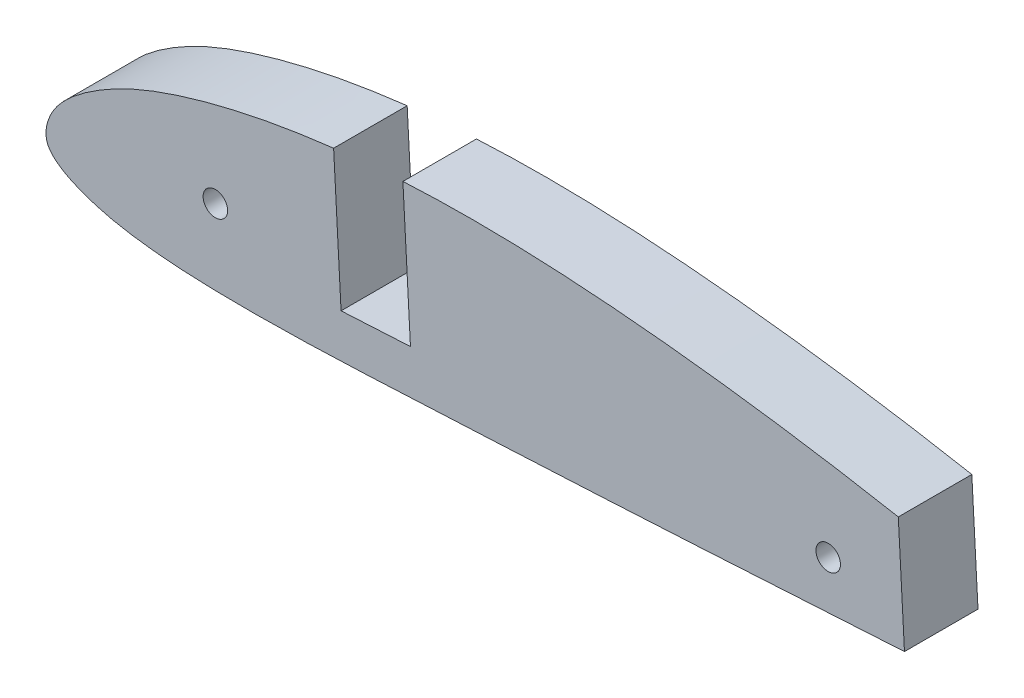
ISO-10303-21;
HEADER;
FILE_DESCRIPTION(('STEP AP214'),'2;1');
FILE_NAME('part.step','',(''),(''),'','','');
FILE_SCHEMA(('AUTOMOTIVE_DESIGN { 1 0 10303 214 1 1 1 1 }'));
ENDSEC;
DATA;
#1=APPLICATION_CONTEXT('core data for automotive mechanical design processes');
#2=APPLICATION_PROTOCOL_DEFINITION('international standard','automotive_design',2000,#1);
#3=PRODUCT_CONTEXT('',#1,'mechanical');
#4=PRODUCT('Part','Part','',(#3));
#5=PRODUCT_RELATED_PRODUCT_CATEGORY('part','',(#4));
#6=PRODUCT_DEFINITION_FORMATION('','',#4);
#7=PRODUCT_DEFINITION_CONTEXT('part definition',#1,'design');
#8=PRODUCT_DEFINITION('design','',#6,#7);
#9=PRODUCT_DEFINITION_SHAPE('','',#8);
#10=(LENGTH_UNIT() NAMED_UNIT(*) SI_UNIT(.MILLI.,.METRE.));
#11=(NAMED_UNIT(*) PLANE_ANGLE_UNIT() SI_UNIT($,.RADIAN.));
#12=(NAMED_UNIT(*) SI_UNIT($,.STERADIAN.) SOLID_ANGLE_UNIT());
#13=UNCERTAINTY_MEASURE_WITH_UNIT(LENGTH_MEASURE(1.E-05),#10,'distance_accuracy_value','');
#14=(GEOMETRIC_REPRESENTATION_CONTEXT(3) GLOBAL_UNCERTAINTY_ASSIGNED_CONTEXT((#13)) GLOBAL_UNIT_ASSIGNED_CONTEXT((#10,
#11,#12)) REPRESENTATION_CONTEXT('',''));
#15=CARTESIAN_POINT('',(0.,0.,0.));
#16=DIRECTION('',(0.,0.,1.));
#17=DIRECTION('',(1.,0.,0.));
#18=AXIS2_PLACEMENT_3D('',#15,#16,#17);
#19=CARTESIAN_POINT('',(109.451798245431,-5.08,7.62));
#20=CARTESIAN_POINT('',(109.454459178744,-5.0694258075468,7.62));
#21=CARTESIAN_POINT('',(109.156485113387,-4.98893370323383,7.62));
#22=CARTESIAN_POINT('',(108.862479978843,-4.85461195717568,7.62));
#23=CARTESIAN_POINT('',(108.123918831792,-4.60117460669964,7.62));
#24=CARTESIAN_POINT('',(107.210252378163,-4.27511376250752,7.62));
#25=CARTESIAN_POINT('',(105.996957401387,-3.86412804078641,7.62));
#26=CARTESIAN_POINT('',(104.53923708378,-3.39638968784611,7.62));
#27=CARTESIAN_POINT('',(102.825319980878,-2.87269416847168,7.62));
#28=CARTESIAN_POINT('',(100.868609031412,-2.30429498547947,7.62));
#29=CARTESIAN_POINT('',(98.677120018108,-1.68869250290389,7.62));
#30=CARTESIAN_POINT('',(96.2607696880802,-1.03022566798201,7.62));
#31=CARTESIAN_POINT('',(93.6287885564061,-0.338112688202309,7.62));
#32=CARTESIAN_POINT('',(90.7922213295436,0.379443625793548,7.62));
#33=CARTESIAN_POINT('',(87.763546501109,1.11431874333265,7.62));
#34=CARTESIAN_POINT('',(84.5564227101674,1.86229543610744,7.62));
#35=CARTESIAN_POINT('',(81.1839302502545,2.61699936289568,7.62));
#36=CARTESIAN_POINT('',(77.6604626634929,3.37053566938624,7.62));
#37=CARTESIAN_POINT('',(74.0010871470234,4.11297119869992,7.62));
#38=CARTESIAN_POINT('',(70.2214341758904,4.83293517068693,7.62));
#39=CARTESIAN_POINT('',(66.3383847064585,5.52614773239327,7.62));
#40=CARTESIAN_POINT('',(62.3677609232154,6.18164020219338,7.62));
#41=CARTESIAN_POINT('',(58.3265125103218,6.79467104657786,7.62));
#42=CARTESIAN_POINT('',(54.2322654270605,7.3581142754929,7.62));
#43=CARTESIAN_POINT('',(50.1022571746908,7.86521701869206,7.62));
#44=CARTESIAN_POINT('',(45.9552044921986,8.314460056631,7.62));
#45=CARTESIAN_POINT('',(41.8078837688901,8.69458239306826,7.62));
#46=CARTESIAN_POINT('',(37.6778363852409,8.99935984883897,7.62));
#47=CARTESIAN_POINT('',(33.5831190485169,9.21958181200142,7.62));
#48=CARTESIAN_POINT('',(29.5409359542949,9.34484403364536,7.62));
#49=CARTESIAN_POINT('',(25.5691488449866,9.36615166551586,7.62));
#50=CARTESIAN_POINT('',(21.6842898563108,9.28357115971868,7.62));
#51=CARTESIAN_POINT('',(17.9029694699595,9.09080508611618,7.62));
#52=CARTESIAN_POINT('',(14.2414370042572,8.7901066249628,7.62));
#53=CARTESIAN_POINT('',(10.7158433347186,8.38653772777966,7.62));
#54=CARTESIAN_POINT('',(7.34129415025395,7.8879080307597,7.62));
#55=CARTESIAN_POINT('',(4.13154087545609,7.30231347263919,7.62));
#56=CARTESIAN_POINT('',(1.10132100092707,6.62948617803047,7.62));
#57=CARTESIAN_POINT('',(-1.73752956384269,5.88532139130179,7.62));
#58=CARTESIAN_POINT('',(-4.37422419748082,5.08138202904439,7.62));
#59=CARTESIAN_POINT('',(-6.79803409663357,4.21512382907975,7.62));
#60=CARTESIAN_POINT('',(-8.99434944048081,3.2765844082489,7.62));
#61=CARTESIAN_POINT('',(-10.9551443346364,2.28063145613607,7.62));
#62=CARTESIAN_POINT('',(-12.6686354294678,1.24621608471318,7.62));
#63=CARTESIAN_POINT('',(-14.1399104434869,0.212705200843522,7.62));
#64=CARTESIAN_POINT('',(-15.3576774886313,-0.820744476133744,7.62));
#65=CARTESIAN_POINT('',(-16.3295875394342,-1.85673893959521,7.62));
#66=CARTESIAN_POINT('',(-17.0202628363783,-2.92281035826037,7.62));
#67=CARTESIAN_POINT('',(-17.4333115493092,-3.96809924516641,7.62));
#68=CARTESIAN_POINT('',(-17.5940544635785,-4.93610308833838,7.62));
#69=CARTESIAN_POINT('',(-17.4702175183407,-5.8088750473589,7.62));
#70=CARTESIAN_POINT('',(-17.0086699305709,-6.54105129294257,7.62));
#71=CARTESIAN_POINT('',(-16.2891353909068,-7.16046076096368,7.62));
#72=CARTESIAN_POINT('',(-15.3346647951794,-7.75507397664849,7.62));
#73=CARTESIAN_POINT('',(-14.1159134721564,-8.30420201060925,7.62));
#74=CARTESIAN_POINT('',(-12.6509130514106,-8.82509795076425,7.62));
#75=CARTESIAN_POINT('',(-10.9336053977492,-9.28593558990606,7.62));
#76=CARTESIAN_POINT('',(-8.97172749068822,-9.66043772730412,7.62));
#77=CARTESIAN_POINT('',(-6.77656462348316,-9.95195932071161,7.62));
#78=CARTESIAN_POINT('',(-4.35740448122734,-10.1686680412697,7.62));
#79=CARTESIAN_POINT('',(-1.72342073780623,-10.3101291264901,7.62));
#80=CARTESIAN_POINT('',(1.11440166995971,-10.3826502445106,7.62));
#81=CARTESIAN_POINT('',(4.14351152847955,-10.3925875239466,7.62));
#82=CARTESIAN_POINT('',(7.35101774838941,-10.3534470410694,7.62));
#83=CARTESIAN_POINT('',(10.7239168059759,-10.264224791165,7.62));
#84=CARTESIAN_POINT('',(14.2476307401474,-10.129211039176,7.62));
#85=CARTESIAN_POINT('',(17.9071565324739,-9.96369874462537,7.62));
#86=CARTESIAN_POINT('',(21.6864453218922,-9.77790103308645,7.62));
#87=CARTESIAN_POINT('',(25.5695768287591,-9.58317083590831,7.62));
#88=CARTESIAN_POINT('',(29.5400512381537,-9.38439462786708,7.62));
#89=CARTESIAN_POINT('',(33.5812406526052,-9.1804648701214,7.62));
#90=CARTESIAN_POINT('',(37.6753635670211,-8.97045350143588,7.62));
#91=CARTESIAN_POINT('',(41.8050014681156,-8.75232303328595,7.62));
#92=CARTESIAN_POINT('',(45.9520094179179,-8.52678932796871,7.62));
#93=CARTESIAN_POINT('',(50.0989896584316,-8.29352213368191,7.62));
#94=CARTESIAN_POINT('',(54.22851261619,-8.05307324658175,7.62));
#95=CARTESIAN_POINT('',(58.3225536689468,-7.81105207853357,7.62));
#96=CARTESIAN_POINT('',(62.3635230482833,-7.5677489493029,7.62));
#97=CARTESIAN_POINT('',(66.3337872257702,-7.33055097205794,7.62));
#98=CARTESIAN_POINT('',(70.2170918118519,-7.10809985442077,7.62));
#99=CARTESIAN_POINT('',(73.9964965572419,-6.89630938119349,7.62));
#100=CARTESIAN_POINT('',(77.6562936872747,-6.70284979119374,7.62));
#101=CARTESIAN_POINT('',(81.1801695815124,-6.52419217673032,7.62));
#102=CARTESIAN_POINT('',(84.5529085687228,-6.35943107843176,7.62));
#103=CARTESIAN_POINT('',(87.7601338312092,-6.20766383934902,7.62));
#104=CARTESIAN_POINT('',(90.7886329934889,-6.06646449572272,7.62));
#105=CARTESIAN_POINT('',(93.6253979865986,-5.93838956358563,7.62));
#106=CARTESIAN_POINT('',(96.2577118500916,-5.82314289841665,7.62));
#107=CARTESIAN_POINT('',(98.6744610539927,-5.71964839534074,7.62));
#108=CARTESIAN_POINT('',(100.865946841829,-5.6315282191389,7.62));
#109=CARTESIAN_POINT('',(102.821934837846,-5.54772865199865,7.62));
#110=CARTESIAN_POINT('',(104.53613188645,-5.46471344288444,7.62));
#111=CARTESIAN_POINT('',(105.994206930004,-5.37725554744643,7.62));
#112=CARTESIAN_POINT('',(107.208082176059,-5.28791450814866,7.62));
#113=CARTESIAN_POINT('',(108.124802464815,-5.20398421107318,7.62));
#114=CARTESIAN_POINT('',(108.85757946549,-5.14653128494667,7.62));
#115=CARTESIAN_POINT('',(109.164058559743,-5.09586083170714,7.62));
#116=CARTESIAN_POINT('',(109.449285024419,-5.08998720356141,7.62));
#117=CARTESIAN_POINT('',(109.451798245431,-5.08,7.62));
#118=B_SPLINE_CURVE_WITH_KNOTS('',3,(#19,#20,#21,#22,#23,#24,#25,#26,#27,#28,#29,#30,#31,#32,
#33,#34,#35,#36,#37,#38,#39,#40,#41,#42,#43,#44,#45,#46,#47,#48,#49,#50,#51,#52,#53,#54,#55,#56,
#57,#58,#59,#60,#61,#62,#63,#64,#65,#66,#67,#68,#69,#70,#71,#72,#73,#74,#75,#76,#77,#78,#79,#80,
#81,#82,#83,#84,#85,#86,#87,#88,#89,#90,#91,#92,#93,#94,#95,#96,#97,#98,#99,#100,#101,#102,#103,
#104,#105,#106,#107,#108,#109,#110,#111,#112,#113,#114,#115,#116,#117),.UNSPECIFIED.,.T.,.F.,(4,
1,1,1,1,1,1,1,1,1,1,1,1,1,1,1,1,1,1,1,1,1,1,1,1,1,1,1,1,1,1,1,1,1,1,1,1,1,1,1,1,1,1,1,1,1,1,1,1,
1,1,1,1,1,1,1,1,1,1,1,1,1,1,1,1,1,1,1,1,1,1,1,1,1,1,1,1,1,1,1,1,1,1,1,1,1,1,1,1,1,1,1,1,1,1,1,
4),(0.,0.000551748168968909,0.00220699267587564,0.00495331783629987,0.00876859672551885,
0.0136237103771035,0.0194917544957015,0.0263313761663127,0.034118237721617,0.042814763955343,
0.0523803885286978,0.062780118387526,0.0739593343954944,0.085864937864062,0.0984463037826211,
0.111647061015066,0.12541472895254,0.139681018693595,0.15437827235737,0.169446877618796,
0.184821177621069,0.200432900996903,0.216223779700666,0.232116858767118,0.248051215843782,
0.263959620823849,0.27977654948636,0.295442408690199,0.310884918055121,0.326054012337802,
0.340892172022955,0.35534852787555,0.369377925346872,0.382929883149188,0.395952713293497,
0.408409584981713,0.420261404507798,0.431467240770188,0.441987752365542,0.451798802150431,
0.460909689796347,0.469303541319367,0.476945895645793,0.483797690745962,0.489858127722002,
0.495197566311554,0.499996833289607,0.504303705219507,0.507974055932029,0.511122506497602,
0.514149355613404,0.517650443947016,0.52191241533645,0.52698225509372,0.532915788027298,
0.539692296023927,0.547308644858914,0.555757425724944,0.565025083316679,0.575098193409434,
0.585939785327677,0.597509158845338,0.609762380674192,0.622648893896746,0.636121864611897,
0.65011775904116,0.664572179415376,0.679425295742404,0.694613250277112,0.710068303100324,
0.725732642993377,0.741529126657818,0.757394896143958,0.773262272158925,0.789063314563828,
0.804734339670543,0.820197409138393,0.835393047804989,0.85025214178361,0.864711863809533,
0.878713432162598,0.892194296731273,0.905091860230497,0.917358005148609,0.928939747527773,
0.939788482525128,0.949855830913999,0.959093409025121,0.967472191854875,0.974954677217858,
0.981503132690762,0.987099408627994,0.991709920982455,0.995322895771173,0.997916481877858,
0.999478880179029,1.),.UNSPECIFIED.);
#119=DIRECTION('',(0.,0.,-1.));
#120=VECTOR('',#119,1.);
#121=SURFACE_OF_LINEAR_EXTRUSION('',#118,#120);
#122=CARTESIAN_POINT('',(70.7635123795649,4.72482615481051,7.62));
#123=VERTEX_POINT('',#122);
#124=CARTESIAN_POINT('',(19.4319078031195,9.16342508950096,7.62));
#125=VERTEX_POINT('',#124);
#126=EDGE_CURVE('E44',#123,#125,#118,.T.);
#127=ORIENTED_EDGE('',*,*,#126,.F.);
#128=DIRECTION('',(0.,0.,-1.));
#129=VECTOR('',#128,1.);
#130=CARTESIAN_POINT('',(70.7635123795649,4.72482615481051,-16.4103345696788));
#131=LINE('',#130,#129);
#132=CARTESIAN_POINT('',(70.7635123795649,4.72482615481051,0.));
#133=VERTEX_POINT('',#132);
#134=EDGE_CURVE('E89',#133,#123,#131,.F.);
#135=ORIENTED_EDGE('',*,*,#134,.F.);
#136=CARTESIAN_POINT('',(109.451798245431,-5.08,0.));
#137=CARTESIAN_POINT('',(109.454459178744,-5.0694258075468,0.));
#138=CARTESIAN_POINT('',(109.156485113387,-4.98893370323383,0.));
#139=CARTESIAN_POINT('',(108.862479978843,-4.85461195717568,0.));
#140=CARTESIAN_POINT('',(108.123918831792,-4.60117460669964,0.));
#141=CARTESIAN_POINT('',(107.210252378163,-4.27511376250752,0.));
#142=CARTESIAN_POINT('',(105.996957401387,-3.86412804078641,0.));
#143=CARTESIAN_POINT('',(104.53923708378,-3.39638968784611,0.));
#144=CARTESIAN_POINT('',(102.825319980878,-2.87269416847168,0.));
#145=CARTESIAN_POINT('',(100.868609031412,-2.30429498547947,0.));
#146=CARTESIAN_POINT('',(98.677120018108,-1.68869250290389,0.));
#147=CARTESIAN_POINT('',(96.2607696880802,-1.03022566798201,0.));
#148=CARTESIAN_POINT('',(93.6287885564061,-0.338112688202309,0.));
#149=CARTESIAN_POINT('',(90.7922213295436,0.379443625793548,0.));
#150=CARTESIAN_POINT('',(87.763546501109,1.11431874333265,0.));
#151=CARTESIAN_POINT('',(84.5564227101674,1.86229543610744,0.));
#152=CARTESIAN_POINT('',(81.1839302502545,2.61699936289568,0.));
#153=CARTESIAN_POINT('',(77.6604626634929,3.37053566938624,0.));
#154=CARTESIAN_POINT('',(74.0010871470234,4.11297119869992,0.));
#155=CARTESIAN_POINT('',(70.2214341758904,4.83293517068693,0.));
#156=CARTESIAN_POINT('',(66.3383847064585,5.52614773239327,0.));
#157=CARTESIAN_POINT('',(62.3677609232154,6.18164020219338,0.));
#158=CARTESIAN_POINT('',(58.3265125103218,6.79467104657786,0.));
#159=CARTESIAN_POINT('',(54.2322654270605,7.3581142754929,0.));
#160=CARTESIAN_POINT('',(50.1022571746908,7.86521701869206,0.));
#161=CARTESIAN_POINT('',(45.9552044921986,8.314460056631,0.));
#162=CARTESIAN_POINT('',(41.8078837688901,8.69458239306826,0.));
#163=CARTESIAN_POINT('',(37.6778363852409,8.99935984883897,0.));
#164=CARTESIAN_POINT('',(33.5831190485169,9.21958181200142,0.));
#165=CARTESIAN_POINT('',(29.5409359542949,9.34484403364536,0.));
#166=CARTESIAN_POINT('',(25.5691488449866,9.36615166551586,0.));
#167=CARTESIAN_POINT('',(21.6842898563108,9.28357115971868,0.));
#168=CARTESIAN_POINT('',(17.9029694699595,9.09080508611618,0.));
#169=CARTESIAN_POINT('',(14.2414370042572,8.7901066249628,0.));
#170=CARTESIAN_POINT('',(10.7158433347186,8.38653772777966,0.));
#171=CARTESIAN_POINT('',(7.34129415025395,7.8879080307597,0.));
#172=CARTESIAN_POINT('',(4.13154087545609,7.30231347263919,0.));
#173=CARTESIAN_POINT('',(1.10132100092707,6.62948617803047,0.));
#174=CARTESIAN_POINT('',(-1.73752956384269,5.88532139130179,0.));
#175=CARTESIAN_POINT('',(-4.37422419748082,5.08138202904439,0.));
#176=CARTESIAN_POINT('',(-6.79803409663357,4.21512382907975,0.));
#177=CARTESIAN_POINT('',(-8.99434944048081,3.2765844082489,0.));
#178=CARTESIAN_POINT('',(-10.9551443346364,2.28063145613607,0.));
#179=CARTESIAN_POINT('',(-12.6686354294678,1.24621608471318,0.));
#180=CARTESIAN_POINT('',(-14.1399104434869,0.212705200843522,0.));
#181=CARTESIAN_POINT('',(-15.3576774886313,-0.820744476133744,0.));
#182=CARTESIAN_POINT('',(-16.3295875394342,-1.85673893959521,0.));
#183=CARTESIAN_POINT('',(-17.0202628363783,-2.92281035826037,0.));
#184=CARTESIAN_POINT('',(-17.4333115493092,-3.96809924516641,0.));
#185=CARTESIAN_POINT('',(-17.5940544635785,-4.93610308833838,0.));
#186=CARTESIAN_POINT('',(-17.4702175183407,-5.8088750473589,0.));
#187=CARTESIAN_POINT('',(-17.0086699305709,-6.54105129294257,0.));
#188=CARTESIAN_POINT('',(-16.2891353909068,-7.16046076096368,0.));
#189=CARTESIAN_POINT('',(-15.3346647951794,-7.75507397664849,0.));
#190=CARTESIAN_POINT('',(-14.1159134721564,-8.30420201060925,0.));
#191=CARTESIAN_POINT('',(-12.6509130514106,-8.82509795076425,0.));
#192=CARTESIAN_POINT('',(-10.9336053977492,-9.28593558990606,0.));
#193=CARTESIAN_POINT('',(-8.97172749068822,-9.66043772730412,0.));
#194=CARTESIAN_POINT('',(-6.77656462348316,-9.95195932071161,0.));
#195=CARTESIAN_POINT('',(-4.35740448122734,-10.1686680412697,0.));
#196=CARTESIAN_POINT('',(-1.72342073780623,-10.3101291264901,0.));
#197=CARTESIAN_POINT('',(1.11440166995971,-10.3826502445106,0.));
#198=CARTESIAN_POINT('',(4.14351152847955,-10.3925875239466,0.));
#199=CARTESIAN_POINT('',(7.35101774838941,-10.3534470410694,0.));
#200=CARTESIAN_POINT('',(10.7239168059759,-10.264224791165,0.));
#201=CARTESIAN_POINT('',(14.2476307401474,-10.129211039176,0.));
#202=CARTESIAN_POINT('',(17.9071565324739,-9.96369874462537,0.));
#203=CARTESIAN_POINT('',(21.6864453218922,-9.77790103308645,0.));
#204=CARTESIAN_POINT('',(25.5695768287591,-9.58317083590831,0.));
#205=CARTESIAN_POINT('',(29.5400512381537,-9.38439462786708,0.));
#206=CARTESIAN_POINT('',(33.5812406526052,-9.1804648701214,0.));
#207=CARTESIAN_POINT('',(37.6753635670211,-8.97045350143588,0.));
#208=CARTESIAN_POINT('',(41.8050014681156,-8.75232303328595,0.));
#209=CARTESIAN_POINT('',(45.9520094179179,-8.52678932796871,0.));
#210=CARTESIAN_POINT('',(50.0989896584316,-8.29352213368191,0.));
#211=CARTESIAN_POINT('',(54.22851261619,-8.05307324658175,0.));
#212=CARTESIAN_POINT('',(58.3225536689468,-7.81105207853357,0.));
#213=CARTESIAN_POINT('',(62.3635230482833,-7.5677489493029,0.));
#214=CARTESIAN_POINT('',(66.3337872257702,-7.33055097205794,0.));
#215=CARTESIAN_POINT('',(70.2170918118519,-7.10809985442077,0.));
#216=CARTESIAN_POINT('',(73.9964965572419,-6.89630938119349,0.));
#217=CARTESIAN_POINT('',(77.6562936872747,-6.70284979119374,0.));
#218=CARTESIAN_POINT('',(81.1801695815124,-6.52419217673032,0.));
#219=CARTESIAN_POINT('',(84.5529085687228,-6.35943107843176,0.));
#220=CARTESIAN_POINT('',(87.7601338312092,-6.20766383934902,0.));
#221=CARTESIAN_POINT('',(90.7886329934889,-6.06646449572272,0.));
#222=CARTESIAN_POINT('',(93.6253979865986,-5.93838956358563,0.));
#223=CARTESIAN_POINT('',(96.2577118500916,-5.82314289841665,0.));
#224=CARTESIAN_POINT('',(98.6744610539927,-5.71964839534074,0.));
#225=CARTESIAN_POINT('',(100.865946841829,-5.6315282191389,0.));
#226=CARTESIAN_POINT('',(102.821934837846,-5.54772865199865,0.));
#227=CARTESIAN_POINT('',(104.53613188645,-5.46471344288444,0.));
#228=CARTESIAN_POINT('',(105.994206930004,-5.37725554744643,0.));
#229=CARTESIAN_POINT('',(107.208082176059,-5.28791450814866,0.));
#230=CARTESIAN_POINT('',(108.124802464815,-5.20398421107318,0.));
#231=CARTESIAN_POINT('',(108.85757946549,-5.14653128494667,0.));
#232=CARTESIAN_POINT('',(109.164058559743,-5.09586083170714,0.));
#233=CARTESIAN_POINT('',(109.449285024419,-5.08998720356141,0.));
#234=CARTESIAN_POINT('',(109.451798245431,-5.08,0.));
#235=B_SPLINE_CURVE_WITH_KNOTS('',3,(#136,#137,#138,#139,#140,#141,#142,#143,#144,#145,#146,
#147,#148,#149,#150,#151,#152,#153,#154,#155,#156,#157,#158,#159,#160,#161,#162,#163,#164,#165,
#166,#167,#168,#169,#170,#171,#172,#173,#174,#175,#176,#177,#178,#179,#180,#181,#182,#183,#184,
#185,#186,#187,#188,#189,#190,#191,#192,#193,#194,#195,#196,#197,#198,#199,#200,#201,#202,#203,
#204,#205,#206,#207,#208,#209,#210,#211,#212,#213,#214,#215,#216,#217,#218,#219,#220,#221,#222,
#223,#224,#225,#226,#227,#228,#229,#230,#231,#232,#233,#234),.UNSPECIFIED.,.T.,.F.,(4,1,1,1,1,1,
1,1,1,1,1,1,1,1,1,1,1,1,1,1,1,1,1,1,1,1,1,1,1,1,1,1,1,1,1,1,1,1,1,1,1,1,1,1,1,1,1,1,1,1,1,1,1,1,
1,1,1,1,1,1,1,1,1,1,1,1,1,1,1,1,1,1,1,1,1,1,1,1,1,1,1,1,1,1,1,1,1,1,1,1,1,1,1,1,1,1,4),(0.,
0.000551748168968909,0.00220699267587564,0.00495331783629987,0.00876859672551885,
0.0136237103771035,0.0194917544957015,0.0263313761663127,0.034118237721617,0.042814763955343,
0.0523803885286978,0.062780118387526,0.0739593343954944,0.085864937864062,0.0984463037826211,
0.111647061015066,0.12541472895254,0.139681018693595,0.15437827235737,0.169446877618796,
0.184821177621069,0.200432900996903,0.216223779700666,0.232116858767118,0.248051215843782,
0.263959620823849,0.27977654948636,0.295442408690199,0.310884918055121,0.326054012337802,
0.340892172022955,0.35534852787555,0.369377925346872,0.382929883149188,0.395952713293497,
0.408409584981713,0.420261404507798,0.431467240770188,0.441987752365542,0.451798802150431,
0.460909689796347,0.469303541319367,0.476945895645793,0.483797690745962,0.489858127722002,
0.495197566311554,0.499996833289607,0.504303705219507,0.507974055932029,0.511122506497602,
0.514149355613404,0.517650443947016,0.52191241533645,0.52698225509372,0.532915788027298,
0.539692296023927,0.547308644858914,0.555757425724944,0.565025083316679,0.575098193409434,
0.585939785327677,0.597509158845338,0.609762380674192,0.622648893896746,0.636121864611897,
0.65011775904116,0.664572179415376,0.679425295742404,0.694613250277112,0.710068303100324,
0.725732642993377,0.741529126657818,0.757394896143958,0.773262272158925,0.789063314563828,
0.804734339670543,0.820197409138393,0.835393047804989,0.85025214178361,0.864711863809533,
0.878713432162598,0.892194296731273,0.905091860230497,0.917358005148609,0.928939747527773,
0.939788482525128,0.949855830913999,0.959093409025121,0.967472191854875,0.974954677217858,
0.981503132690762,0.987099408627994,0.991709920982455,0.995322895771173,0.997916481877858,
0.999478880179029,1.),.UNSPECIFIED.);
#236=CARTESIAN_POINT('',(19.431907809241,9.16342508983322,0.));
#237=VERTEX_POINT('',#236);
#238=EDGE_CURVE('E109',#133,#237,#235,.T.);
#239=ORIENTED_EDGE('',*,*,#238,.T.);
#240=DIRECTION('',(0.,0.,-1.));
#241=VECTOR('',#240,1.);
#242=CARTESIAN_POINT('',(19.4319078031194,9.16342508950334,7.62));
#243=LINE('',#242,#241);
#244=EDGE_CURVE('E59',#237,#125,#243,.F.);
#245=ORIENTED_EDGE('',*,*,#244,.T.);
#246=EDGE_LOOP('',(#127,#135,#239,#245));
#247=FACE_BOUND('',#246,.T.);
#248=ADVANCED_FACE('F35',(#247),#121,.F.);
#249=CARTESIAN_POINT('',(12.2541928366214,8.55760175136727,0.));
#250=VERTEX_POINT('',#249);
#251=CARTESIAN_POINT('',(71.4022099405351,-7.04200673350193,0.));
#252=VERTEX_POINT('',#251);
#253=EDGE_CURVE('E103',#250,#252,#235,.T.);
#254=ORIENTED_EDGE('',*,*,#253,.T.);
#255=DIRECTION('',(0.,0.,-1.));
#256=VECTOR('',#255,1.);
#257=CARTESIAN_POINT('',(71.4022099405351,-7.04200673350193,-16.4103345696788));
#258=LINE('',#257,#256);
#259=CARTESIAN_POINT('',(71.4022099405351,-7.04200673350193,7.62));
#260=VERTEX_POINT('',#259);
#261=EDGE_CURVE('E51',#252,#260,#258,.F.);
#262=ORIENTED_EDGE('',*,*,#261,.T.);
#263=CARTESIAN_POINT('',(12.2541928366213,8.55760175136727,7.62));
#264=VERTEX_POINT('',#263);
#265=EDGE_CURVE('E101',#264,#260,#118,.T.);
#266=ORIENTED_EDGE('',*,*,#265,.F.);
#267=DIRECTION('',(0.,0.,-1.));
#268=VECTOR('',#267,1.);
#269=CARTESIAN_POINT('',(12.2541928366213,8.55760175136726,7.62));
#270=LINE('',#269,#268);
#271=EDGE_CURVE('E115',#264,#250,#270,.T.);
#272=ORIENTED_EDGE('',*,*,#271,.T.);
#273=EDGE_LOOP('',(#254,#262,#266,#272));
#274=FACE_BOUND('',#273,.T.);
#275=ADVANCED_FACE('F37',(#274),#121,.F.);
#276=CARTESIAN_POINT('',(-17.005018401707,-2.98016125510176,7.62));
#277=DIRECTION('',(0.,0.,-1.));
#278=DIRECTION('',(-1.,0.,0.));
#279=AXIS2_PLACEMENT_3D('',#276,#277,#278);
#280=PLANE('',#279);
#281=CARTESIAN_POINT('',(0.,-2.54,7.62));
#282=DIRECTION('',(0.,0.,1.));
#283=DIRECTION('',(1.,0.,0.));
#284=AXIS2_PLACEMENT_3D('',#281,#282,#283);
#285=CIRCLE('',#284,1.27);
#286=CARTESIAN_POINT('',(1.27,-2.54,7.61999999999999));
#287=VERTEX_POINT('',#286);
#288=EDGE_CURVE('E148',#287,#287,#285,.T.);
#289=ORIENTED_EDGE('',*,*,#288,.F.);
#290=EDGE_LOOP('',(#289));
#291=FACE_BOUND('',#290,.T.);
#292=CARTESIAN_POINT('',(63.5,-2.54,7.62));
#293=DIRECTION('',(0.,0.,1.));
#294=DIRECTION('',(1.,0.,0.));
#295=AXIS2_PLACEMENT_3D('',#292,#293,#294);
#296=CIRCLE('',#295,1.26999999999999);
#297=CARTESIAN_POINT('',(64.77,-2.54,7.61999999999999));
#298=VERTEX_POINT('',#297);
#299=EDGE_CURVE('E138',#298,#298,#296,.T.);
#300=ORIENTED_EDGE('',*,*,#299,.F.);
#301=EDGE_LOOP('',(#300));
#302=FACE_BOUND('',#301,.T.);
#303=ORIENTED_EDGE('',*,*,#265,.T.);
#304=DIRECTION('',(0.0541996946731651,-0.998530116269578,0.));
#305=VECTOR('',#304,1.);
#306=CARTESIAN_POINT('',(70.7635123795649,4.72482615481051,7.62));
#307=LINE('',#306,#305);
#308=EDGE_CURVE('E86',#123,#260,#307,.T.);
#309=ORIENTED_EDGE('',*,*,#308,.F.);
#310=ORIENTED_EDGE('',*,*,#126,.T.);
#311=DIRECTION('',(-0.0541996946731669,0.998530116269577,0.));
#312=VECTOR('',#311,1.);
#313=CARTESIAN_POINT('',(20.2149173749392,-5.2620923143158,7.62));
#314=LINE('',#313,#312);
#315=CARTESIAN_POINT('',(20.2149173749392,-5.2620923143158,7.62));
#316=VERTEX_POINT('',#315);
#317=EDGE_CURVE('E131',#316,#125,#314,.T.);
#318=ORIENTED_EDGE('',*,*,#317,.F.);
#319=DIRECTION('',(0.998530116269577,0.0541996946731667,0.));
#320=VECTOR('',#319,1.);
#321=CARTESIAN_POINT('',(13.0255005377982,-5.6523301159626,7.62));
#322=LINE('',#321,#320);
#323=CARTESIAN_POINT('',(13.0255005377982,-5.6523301159626,7.62));
#324=VERTEX_POINT('',#323);
#325=EDGE_CURVE('E140',#324,#316,#322,.T.);
#326=ORIENTED_EDGE('',*,*,#325,.F.);
#327=DIRECTION('',(0.0541996946731667,-0.998530116269577,0.));
#328=VECTOR('',#327,1.);
#329=CARTESIAN_POINT('',(12.0979054178089,11.4369112275429,7.62));
#330=LINE('',#329,#328);
#331=EDGE_CURVE('E108',#264,#324,#330,.T.);
#332=ORIENTED_EDGE('',*,*,#331,.F.);
#333=EDGE_LOOP('',(#303,#309,#310,#318,#326,#332));
#334=FACE_BOUND('',#333,.T.);
#335=ADVANCED_FACE('F106',(#291,#302,#334),#280,.F.);
#336=CARTESIAN_POINT('',(-17.005018401707,-2.98016125510176,0.));
#337=DIRECTION('',(0.,0.,-1.));
#338=DIRECTION('',(-1.,0.,0.));
#339=AXIS2_PLACEMENT_3D('',#336,#337,#338);
#340=PLANE('',#339);
#341=CARTESIAN_POINT('',(0.,-2.54,0.));
#342=DIRECTION('',(0.,0.,-1.));
#343=DIRECTION('',(-1.,0.,0.));
#344=AXIS2_PLACEMENT_3D('',#341,#342,#343);
#345=CIRCLE('',#344,1.27);
#346=CARTESIAN_POINT('',(1.27,-2.54,0.));
#347=VERTEX_POINT('',#346);
#348=EDGE_CURVE('E126',#347,#347,#345,.F.);
#349=ORIENTED_EDGE('',*,*,#348,.T.);
#350=EDGE_LOOP('',(#349));
#351=FACE_BOUND('',#350,.T.);
#352=DIRECTION('',(0.0541996946731651,-0.998530116269578,0.));
#353=VECTOR('',#352,1.);
#354=CARTESIAN_POINT('',(70.7635123795649,4.72482615481051,0.));
#355=LINE('',#354,#353);
#356=EDGE_CURVE('E94',#133,#252,#355,.T.);
#357=ORIENTED_EDGE('',*,*,#356,.T.);
#358=ORIENTED_EDGE('',*,*,#253,.F.);
#359=DIRECTION('',(-0.0541996946731668,0.998530116269577,0.));
#360=VECTOR('',#359,1.);
#361=CARTESIAN_POINT('',(12.7926648260402,-1.36275852823636,0.));
#362=LINE('',#361,#360);
#363=CARTESIAN_POINT('',(13.0255005377982,-5.6523301159626,0.));
#364=VERTEX_POINT('',#363);
#365=EDGE_CURVE('E11',#364,#250,#362,.T.);
#366=ORIENTED_EDGE('',*,*,#365,.F.);
#367=DIRECTION('',(0.998530116269577,0.0541996946731667,0.));
#368=VECTOR('',#367,1.);
#369=CARTESIAN_POINT('',(13.0255005377982,-5.6523301159626,0.));
#370=LINE('',#369,#368);
#371=CARTESIAN_POINT('',(20.2149173749392,-5.2620923143158,0.));
#372=VERTEX_POINT('',#371);
#373=EDGE_CURVE('E130',#364,#372,#370,.T.);
#374=ORIENTED_EDGE('',*,*,#373,.T.);
#375=DIRECTION('',(-0.0541996946731669,0.998530116269577,0.));
#376=VECTOR('',#375,1.);
#377=CARTESIAN_POINT('',(20.2149173749392,-5.2620923143158,0.));
#378=LINE('',#377,#376);
#379=EDGE_CURVE('E134',#372,#237,#378,.T.);
#380=ORIENTED_EDGE('',*,*,#379,.T.);
#381=ORIENTED_EDGE('',*,*,#238,.F.);
#382=EDGE_LOOP('',(#357,#358,#366,#374,#380,#381));
#383=FACE_BOUND('',#382,.T.);
#384=CARTESIAN_POINT('',(63.5,-2.54,0.));
#385=DIRECTION('',(0.,0.,-1.));
#386=DIRECTION('',(-1.,0.,0.));
#387=AXIS2_PLACEMENT_3D('',#384,#385,#386);
#388=CIRCLE('',#387,1.26999999999999);
#389=CARTESIAN_POINT('',(64.77,-2.54,0.));
#390=VERTEX_POINT('',#389);
#391=EDGE_CURVE('E95',#390,#390,#388,.F.);
#392=ORIENTED_EDGE('',*,*,#391,.T.);
#393=EDGE_LOOP('',(#392));
#394=FACE_BOUND('',#393,.T.);
#395=ADVANCED_FACE('F161',(#351,#383,#394),#340,.T.);
#396=CARTESIAN_POINT('',(12.0979054178089,11.4369112275429,-40.4406691393577));
#397=DIRECTION('',(-0.998530116269577,-0.0541996946731668,0.));
#398=DIRECTION('',(0.0541996946731668,-0.998530116269577,0.));
#399=AXIS2_PLACEMENT_3D('',#396,#397,#398);
#400=PLANE('',#399);
#401=ORIENTED_EDGE('',*,*,#331,.T.);
#402=DIRECTION('',(0.,0.,1.));
#403=VECTOR('',#402,1.);
#404=CARTESIAN_POINT('',(13.0255005377982,-5.6523301159626,-40.4406691393577));
#405=LINE('',#404,#403);
#406=EDGE_CURVE('E127',#364,#324,#405,.T.);
#407=ORIENTED_EDGE('',*,*,#406,.F.);
#408=ORIENTED_EDGE('',*,*,#365,.T.);
#409=ORIENTED_EDGE('',*,*,#271,.F.);
#410=EDGE_LOOP('',(#401,#407,#408,#409));
#411=FACE_BOUND('',#410,.T.);
#412=ADVANCED_FACE('F173',(#411),#400,.F.);
#413=CARTESIAN_POINT('',(20.2149173749392,-5.2620923143158,-40.4406691393577));
#414=DIRECTION('',(0.998530116269577,0.0541996946731669,0.));
#415=DIRECTION('',(-0.0541996946731669,0.998530116269577,0.));
#416=AXIS2_PLACEMENT_3D('',#413,#414,#415);
#417=PLANE('',#416);
#418=ORIENTED_EDGE('',*,*,#379,.F.);
#419=DIRECTION('',(0.,0.,1.));
#420=VECTOR('',#419,1.);
#421=CARTESIAN_POINT('',(20.2149173749392,-5.2620923143158,-40.4406691393577));
#422=LINE('',#421,#420);
#423=EDGE_CURVE('E132',#372,#316,#422,.T.);
#424=ORIENTED_EDGE('',*,*,#423,.T.);
#425=ORIENTED_EDGE('',*,*,#317,.T.);
#426=ORIENTED_EDGE('',*,*,#244,.F.);
#427=EDGE_LOOP('',(#418,#424,#425,#426));
#428=FACE_BOUND('',#427,.T.);
#429=ADVANCED_FACE('F178',(#428),#417,.F.);
#430=CARTESIAN_POINT('',(13.0255005377982,-5.6523301159626,-40.4406691393577));
#431=DIRECTION('',(0.0541996946731667,-0.998530116269577,0.));
#432=DIRECTION('',(0.998530116269577,0.0541996946731667,0.));
#433=AXIS2_PLACEMENT_3D('',#430,#431,#432);
#434=PLANE('',#433);
#435=ORIENTED_EDGE('',*,*,#406,.T.);
#436=ORIENTED_EDGE('',*,*,#325,.T.);
#437=ORIENTED_EDGE('',*,*,#423,.F.);
#438=ORIENTED_EDGE('',*,*,#373,.F.);
#439=EDGE_LOOP('',(#435,#436,#437,#438));
#440=FACE_BOUND('',#439,.T.);
#441=ADVANCED_FACE('F168',(#440),#434,.F.);
#442=CARTESIAN_POINT('',(63.5,-2.54,-40.4406691393577));
#443=DIRECTION('',(0.,0.,1.));
#444=DIRECTION('',(1.,0.,0.));
#445=AXIS2_PLACEMENT_3D('',#442,#443,#444);
#446=CYLINDRICAL_SURFACE('',#445,1.26999999999999);
#447=CARTESIAN_POINT('',(64.77,-2.54,7.61999999999999));
#448=CARTESIAN_POINT('',(64.77,-2.54,7.540625));
#449=CARTESIAN_POINT('',(64.77,-2.54,7.46125));
#450=CARTESIAN_POINT('',(64.77,-2.54,7.3025));
#451=CARTESIAN_POINT('',(64.77,-2.54,7.223125));
#452=CARTESIAN_POINT('',(64.77,-2.54,7.064375));
#453=CARTESIAN_POINT('',(64.77,-2.54,6.985));
#454=CARTESIAN_POINT('',(64.77,-2.54,6.82625));
#455=CARTESIAN_POINT('',(64.77,-2.54,6.746875));
#456=CARTESIAN_POINT('',(64.77,-2.54,6.588125));
#457=CARTESIAN_POINT('',(64.77,-2.54,6.50875));
#458=CARTESIAN_POINT('',(64.77,-2.54,6.34999999999999));
#459=CARTESIAN_POINT('',(64.77,-2.54,6.27062499999999));
#460=CARTESIAN_POINT('',(64.77,-2.54,6.111875));
#461=CARTESIAN_POINT('',(64.77,-2.54,6.0325));
#462=CARTESIAN_POINT('',(64.77,-2.54,5.87375));
#463=CARTESIAN_POINT('',(64.77,-2.54,5.794375));
#464=CARTESIAN_POINT('',(64.77,-2.54,5.635625));
#465=CARTESIAN_POINT('',(64.77,-2.54,5.55625));
#466=CARTESIAN_POINT('',(64.77,-2.54,5.3975));
#467=CARTESIAN_POINT('',(64.77,-2.54,5.318125));
#468=CARTESIAN_POINT('',(64.77,-2.54,5.159375));
#469=CARTESIAN_POINT('',(64.77,-2.54,5.08));
#470=CARTESIAN_POINT('',(64.77,-2.54,4.92125));
#471=CARTESIAN_POINT('',(64.77,-2.54,4.841875));
#472=CARTESIAN_POINT('',(64.77,-2.54,4.683125));
#473=CARTESIAN_POINT('',(64.77,-2.54,4.60375));
#474=CARTESIAN_POINT('',(64.77,-2.54,4.445));
#475=CARTESIAN_POINT('',(64.77,-2.54,4.365625));
#476=CARTESIAN_POINT('',(64.77,-2.54,4.206875));
#477=CARTESIAN_POINT('',(64.77,-2.54,4.1275));
#478=CARTESIAN_POINT('',(64.77,-2.54,3.96875));
#479=CARTESIAN_POINT('',(64.77,-2.54,3.889375));
#480=CARTESIAN_POINT('',(64.77,-2.54,3.730625));
#481=CARTESIAN_POINT('',(64.77,-2.54,3.65125));
#482=CARTESIAN_POINT('',(64.77,-2.54,3.4925));
#483=CARTESIAN_POINT('',(64.77,-2.54,3.413125));
#484=CARTESIAN_POINT('',(64.77,-2.54,3.254375));
#485=CARTESIAN_POINT('',(64.77,-2.54,3.175));
#486=CARTESIAN_POINT('',(64.77,-2.54,3.01625000000001));
#487=CARTESIAN_POINT('',(64.77,-2.54,2.93687500000001));
#488=CARTESIAN_POINT('',(64.77,-2.54,2.778125));
#489=CARTESIAN_POINT('',(64.77,-2.54,2.69875));
#490=CARTESIAN_POINT('',(64.77,-2.54,2.54));
#491=CARTESIAN_POINT('',(64.77,-2.54,2.460625));
#492=CARTESIAN_POINT('',(64.77,-2.54,2.301875));
#493=CARTESIAN_POINT('',(64.77,-2.54,2.2225));
#494=CARTESIAN_POINT('',(64.77,-2.54,2.06375));
#495=CARTESIAN_POINT('',(64.77,-2.54,1.984375));
#496=CARTESIAN_POINT('',(64.77,-2.54,1.825625));
#497=CARTESIAN_POINT('',(64.77,-2.54,1.74625));
#498=CARTESIAN_POINT('',(64.77,-2.54,1.58750000000001));
#499=CARTESIAN_POINT('',(64.77,-2.54,1.50812500000001));
#500=CARTESIAN_POINT('',(64.77,-2.54,1.34937500000001));
#501=CARTESIAN_POINT('',(64.77,-2.54,1.27000000000001));
#502=CARTESIAN_POINT('',(64.77,-2.54,1.11125000000001));
#503=CARTESIAN_POINT('',(64.77,-2.54,1.031875));
#504=CARTESIAN_POINT('',(64.77,-2.54,0.873125000000002));
#505=CARTESIAN_POINT('',(64.77,-2.54,0.793750000000003));
#506=CARTESIAN_POINT('',(64.77,-2.54,0.635000000000004));
#507=CARTESIAN_POINT('',(64.77,-2.54,0.555625000000004));
#508=CARTESIAN_POINT('',(64.77,-2.54,0.396875000000005));
#509=CARTESIAN_POINT('',(64.77,-2.54,0.317500000000005));
#510=CARTESIAN_POINT('',(64.77,-2.54,0.158750000000006));
#511=CARTESIAN_POINT('',(64.77,-2.54,0.0793750000000065));
#512=CARTESIAN_POINT('',(64.77,-2.54,0.));
#513=B_SPLINE_CURVE_WITH_KNOTS('',3,(#447,#448,#449,#450,#451,#452,#453,#454,#455,#456,#457,
#458,#459,#460,#461,#462,#463,#464,#465,#466,#467,#468,#469,#470,#471,#472,#473,#474,#475,#476,
#477,#478,#479,#480,#481,#482,#483,#484,#485,#486,#487,#488,#489,#490,#491,#492,#493,#494,#495,
#496,#497,#498,#499,#500,#501,#502,#503,#504,#505,#506,#507,#508,#509,#510,#511,#512),
.UNSPECIFIED.,.F.,.F.,(4,2,2,2,2,2,2,2,2,2,2,2,2,2,2,2,2,2,2,2,2,2,2,2,2,2,2,2,2,2,2,2,4),(0.,
0.238124999999999,0.476249999999998,0.714374999999996,0.952499999999995,1.190625,1.42875,
1.666875,1.905,2.143125,2.38124999999999,2.61937499999999,2.8575,3.095625,3.33375,3.571875,
3.80999999999999,4.04812499999999,4.28624999999999,4.52437499999999,4.76249999999999,
5.00062499999999,5.23874999999999,5.47687499999999,5.71499999999999,5.95312499999999,
6.19124999999999,6.42937499999999,6.66749999999999,6.90562499999999,7.14374999999999,
7.38187499999999,7.61999999999999),.UNSPECIFIED.);
#514=EDGE_CURVE('BSEAM165',#298,#390,#513,.T.);
#515=ORIENTED_EDGE('',*,*,#299,.T.);
#516=ORIENTED_EDGE('',*,*,#391,.F.);
#517=ORIENTED_EDGE('',*,*,#514,.T.);
#518=ORIENTED_EDGE('',*,*,#514,.F.);
#519=EDGE_LOOP('',(#515,#517,#516,#518));
#520=FACE_BOUND('',#519,.T.);
#521=ADVANCED_FACE('F165',(#520),#446,.F.);
#522=CARTESIAN_POINT('',(70.7635123795649,4.72482615481051,-40.4406691393577));
#523=DIRECTION('',(-0.998530116269577,-0.0541996946731651,0.));
#524=DIRECTION('',(0.0541996946731651,-0.998530116269578,0.));
#525=AXIS2_PLACEMENT_3D('',#522,#523,#524);
#526=PLANE('',#525);
#527=ORIENTED_EDGE('',*,*,#134,.T.);
#528=ORIENTED_EDGE('',*,*,#308,.T.);
#529=ORIENTED_EDGE('',*,*,#261,.F.);
#530=ORIENTED_EDGE('',*,*,#356,.F.);
#531=EDGE_LOOP('',(#527,#528,#529,#530));
#532=FACE_BOUND('',#531,.T.);
#533=ADVANCED_FACE('F87',(#532),#526,.F.);
#534=CARTESIAN_POINT('',(0.,-2.54,-40.4406691393577));
#535=DIRECTION('',(0.,0.,1.));
#536=DIRECTION('',(1.,0.,0.));
#537=AXIS2_PLACEMENT_3D('',#534,#535,#536);
#538=CYLINDRICAL_SURFACE('',#537,1.27);
#539=CARTESIAN_POINT('',(1.27,-2.54,7.61999999999999));
#540=CARTESIAN_POINT('',(1.27,-2.54,7.540625));
#541=CARTESIAN_POINT('',(1.27,-2.54,7.46125));
#542=CARTESIAN_POINT('',(1.27,-2.54,7.3025));
#543=CARTESIAN_POINT('',(1.27,-2.54,7.223125));
#544=CARTESIAN_POINT('',(1.27,-2.54,7.064375));
#545=CARTESIAN_POINT('',(1.27,-2.54,6.985));
#546=CARTESIAN_POINT('',(1.27,-2.54,6.82625));
#547=CARTESIAN_POINT('',(1.27,-2.54,6.746875));
#548=CARTESIAN_POINT('',(1.27,-2.54,6.588125));
#549=CARTESIAN_POINT('',(1.27,-2.54,6.50875));
#550=CARTESIAN_POINT('',(1.27,-2.54,6.34999999999999));
#551=CARTESIAN_POINT('',(1.27,-2.54,6.27062499999999));
#552=CARTESIAN_POINT('',(1.27,-2.54,6.111875));
#553=CARTESIAN_POINT('',(1.27,-2.54,6.0325));
#554=CARTESIAN_POINT('',(1.27,-2.54,5.87375));
#555=CARTESIAN_POINT('',(1.27,-2.54,5.794375));
#556=CARTESIAN_POINT('',(1.27,-2.54,5.635625));
#557=CARTESIAN_POINT('',(1.27,-2.54,5.55625));
#558=CARTESIAN_POINT('',(1.27,-2.54,5.3975));
#559=CARTESIAN_POINT('',(1.27,-2.54,5.318125));
#560=CARTESIAN_POINT('',(1.27,-2.54,5.159375));
#561=CARTESIAN_POINT('',(1.27,-2.54,5.08));
#562=CARTESIAN_POINT('',(1.27,-2.54,4.92125));
#563=CARTESIAN_POINT('',(1.27,-2.54,4.841875));
#564=CARTESIAN_POINT('',(1.27,-2.54,4.683125));
#565=CARTESIAN_POINT('',(1.27,-2.54,4.60375));
#566=CARTESIAN_POINT('',(1.27,-2.54,4.445));
#567=CARTESIAN_POINT('',(1.27,-2.54,4.365625));
#568=CARTESIAN_POINT('',(1.27,-2.54,4.206875));
#569=CARTESIAN_POINT('',(1.27,-2.54,4.1275));
#570=CARTESIAN_POINT('',(1.27,-2.54,3.96875));
#571=CARTESIAN_POINT('',(1.27,-2.54,3.889375));
#572=CARTESIAN_POINT('',(1.27,-2.54,3.730625));
#573=CARTESIAN_POINT('',(1.27,-2.54,3.65125));
#574=CARTESIAN_POINT('',(1.27,-2.54,3.4925));
#575=CARTESIAN_POINT('',(1.27,-2.54,3.413125));
#576=CARTESIAN_POINT('',(1.27,-2.54,3.254375));
#577=CARTESIAN_POINT('',(1.27,-2.54,3.175));
#578=CARTESIAN_POINT('',(1.27,-2.54,3.01625000000001));
#579=CARTESIAN_POINT('',(1.27,-2.54,2.93687500000001));
#580=CARTESIAN_POINT('',(1.27,-2.54,2.778125));
#581=CARTESIAN_POINT('',(1.27,-2.54,2.69875));
#582=CARTESIAN_POINT('',(1.27,-2.54,2.54));
#583=CARTESIAN_POINT('',(1.27,-2.54,2.460625));
#584=CARTESIAN_POINT('',(1.27,-2.54,2.301875));
#585=CARTESIAN_POINT('',(1.27,-2.54,2.2225));
#586=CARTESIAN_POINT('',(1.27,-2.54,2.06375));
#587=CARTESIAN_POINT('',(1.27,-2.54,1.984375));
#588=CARTESIAN_POINT('',(1.27,-2.54,1.825625));
#589=CARTESIAN_POINT('',(1.27,-2.54,1.74625));
#590=CARTESIAN_POINT('',(1.27,-2.54,1.58750000000001));
#591=CARTESIAN_POINT('',(1.27,-2.54,1.50812500000001));
#592=CARTESIAN_POINT('',(1.27,-2.54,1.34937500000001));
#593=CARTESIAN_POINT('',(1.27,-2.54,1.27000000000001));
#594=CARTESIAN_POINT('',(1.27,-2.54,1.11125000000001));
#595=CARTESIAN_POINT('',(1.27,-2.54,1.031875));
#596=CARTESIAN_POINT('',(1.27,-2.54,0.873125000000002));
#597=CARTESIAN_POINT('',(1.27,-2.54,0.793750000000003));
#598=CARTESIAN_POINT('',(1.27,-2.54,0.635000000000004));
#599=CARTESIAN_POINT('',(1.27,-2.54,0.555625000000004));
#600=CARTESIAN_POINT('',(1.27,-2.54,0.396875000000005));
#601=CARTESIAN_POINT('',(1.27,-2.54,0.317500000000005));
#602=CARTESIAN_POINT('',(1.27,-2.54,0.158750000000006));
#603=CARTESIAN_POINT('',(1.27,-2.54,0.0793750000000065));
#604=CARTESIAN_POINT('',(1.27,-2.54,0.));
#605=B_SPLINE_CURVE_WITH_KNOTS('',3,(#539,#540,#541,#542,#543,#544,#545,#546,#547,#548,#549,
#550,#551,#552,#553,#554,#555,#556,#557,#558,#559,#560,#561,#562,#563,#564,#565,#566,#567,#568,
#569,#570,#571,#572,#573,#574,#575,#576,#577,#578,#579,#580,#581,#582,#583,#584,#585,#586,#587,
#588,#589,#590,#591,#592,#593,#594,#595,#596,#597,#598,#599,#600,#601,#602,#603,#604),
.UNSPECIFIED.,.F.,.F.,(4,2,2,2,2,2,2,2,2,2,2,2,2,2,2,2,2,2,2,2,2,2,2,2,2,2,2,2,2,2,2,2,4),(0.,
0.238124999999999,0.476249999999998,0.714374999999996,0.952499999999995,1.190625,1.42875,
1.666875,1.905,2.143125,2.38124999999999,2.61937499999999,2.8575,3.095625,3.33375,3.571875,
3.80999999999999,4.04812499999999,4.28624999999999,4.52437499999999,4.76249999999999,
5.00062499999999,5.23874999999999,5.47687499999999,5.71499999999999,5.95312499999999,
6.19124999999999,6.42937499999999,6.66749999999999,6.90562499999999,7.14374999999999,
7.38187499999999,7.61999999999999),.UNSPECIFIED.);
#606=EDGE_CURVE('BSEAM156',#287,#347,#605,.T.);
#607=ORIENTED_EDGE('',*,*,#288,.T.);
#608=ORIENTED_EDGE('',*,*,#348,.F.);
#609=ORIENTED_EDGE('',*,*,#606,.T.);
#610=ORIENTED_EDGE('',*,*,#606,.F.);
#611=EDGE_LOOP('',(#607,#609,#608,#610));
#612=FACE_BOUND('',#611,.T.);
#613=ADVANCED_FACE('F156',(#612),#538,.F.);
#614=CLOSED_SHELL('',(#248,#275,#335,#395,#412,#429,#441,#521,#533,#613));
#615=MANIFOLD_SOLID_BREP('B2',#614);
#616=ADVANCED_BREP_SHAPE_REPRESENTATION('',(#18,#615),#14);
#617=SHAPE_DEFINITION_REPRESENTATION(#9,#616);
ENDSEC;
END-ISO-10303-21;
